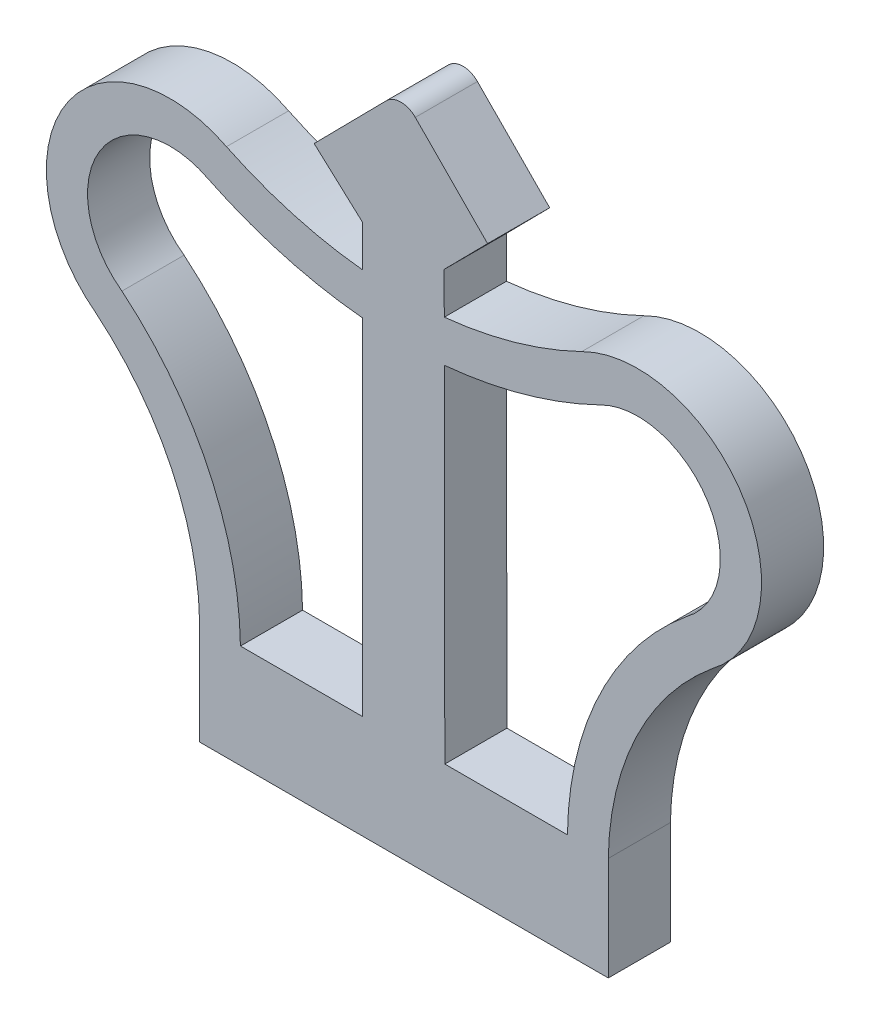
ISO-10303-21;
HEADER;
FILE_DESCRIPTION(('STEP AP214'),'2;1');
FILE_NAME('part.step','',(''),(''),'','','');
FILE_SCHEMA(('AUTOMOTIVE_DESIGN { 1 0 10303 214 1 1 1 1 }'));
ENDSEC;
DATA;
#1=APPLICATION_CONTEXT('core data for automotive mechanical design processes');
#2=APPLICATION_PROTOCOL_DEFINITION('international standard','automotive_design',2000,#1);
#3=PRODUCT_CONTEXT('',#1,'mechanical');
#4=PRODUCT('Part','Part','',(#3));
#5=PRODUCT_RELATED_PRODUCT_CATEGORY('part','',(#4));
#6=PRODUCT_DEFINITION_FORMATION('','',#4);
#7=PRODUCT_DEFINITION_CONTEXT('part definition',#1,'design');
#8=PRODUCT_DEFINITION('design','',#6,#7);
#9=PRODUCT_DEFINITION_SHAPE('','',#8);
#10=(LENGTH_UNIT() NAMED_UNIT(*) SI_UNIT(.MILLI.,.METRE.));
#11=(NAMED_UNIT(*) PLANE_ANGLE_UNIT() SI_UNIT($,.RADIAN.));
#12=(NAMED_UNIT(*) SI_UNIT($,.STERADIAN.) SOLID_ANGLE_UNIT());
#13=UNCERTAINTY_MEASURE_WITH_UNIT(LENGTH_MEASURE(1.E-05),#10,'distance_accuracy_value','');
#14=(GEOMETRIC_REPRESENTATION_CONTEXT(3) GLOBAL_UNCERTAINTY_ASSIGNED_CONTEXT((#13)) GLOBAL_UNIT_ASSIGNED_CONTEXT((#10,
#11,#12)) REPRESENTATION_CONTEXT('',''));
#15=CARTESIAN_POINT('',(0.,0.,0.));
#16=DIRECTION('',(0.,0.,1.));
#17=DIRECTION('',(1.,0.,0.));
#18=AXIS2_PLACEMENT_3D('',#15,#16,#17);
#19=CARTESIAN_POINT('',(61.8441932307296,31.3219073129325,3.));
#20=DIRECTION('',(0.,0.,1.));
#21=DIRECTION('',(1.,0.,0.));
#22=AXIS2_PLACEMENT_3D('',#19,#20,#21);
#23=PLANE('',#22);
#24=CARTESIAN_POINT('',(61.8441932307296,31.3219073129325,3.));
#25=DIRECTION('',(0.,0.,1.));
#26=DIRECTION('',(1.,0.,0.));
#27=AXIS2_PLACEMENT_3D('',#24,#25,#26);
#28=CIRCLE('',#27,0.986666666666719);
#29=CARTESIAN_POINT('',(62.5418719215003,32.0195860037033,3.));
#30=VERTEX_POINT('',#29);
#31=CARTESIAN_POINT('',(61.1465145399588,32.0195860037033,3.));
#32=VERTEX_POINT('',#31);
#33=EDGE_CURVE('E287',#30,#32,#28,.T.);
#34=ORIENTED_EDGE('',*,*,#33,.T.);
#35=DIRECTION('',(-0.702345280394572,-0.71183643283234,0.));
#36=VECTOR('',#35,1.);
#37=CARTESIAN_POINT('',(61.1465145399588,32.0195860037033,3.));
#38=LINE('',#37,#36);
#39=CARTESIAN_POINT('',(57.6581210861052,28.4840520977706,3.));
#40=VERTEX_POINT('',#39);
#41=EDGE_CURVE('E290',#32,#40,#38,.T.);
#42=ORIENTED_EDGE('',*,*,#41,.T.);
#43=DIRECTION('',(0.739794983569367,-0.672832358233163,0.));
#44=VECTOR('',#43,1.);
#45=CARTESIAN_POINT('',(57.6581210861052,28.4840520977706,3.));
#46=LINE('',#45,#44);
#47=CARTESIAN_POINT('',(59.990562636375,26.362731754211,3.));
#48=VERTEX_POINT('',#47);
#49=EDGE_CURVE('E293',#40,#48,#46,.T.);
#50=ORIENTED_EDGE('',*,*,#49,.T.);
#51=DIRECTION('',(0.,-1.,0.));
#52=VECTOR('',#51,1.);
#53=CARTESIAN_POINT('',(59.990562636375,26.362731754211,3.));
#54=LINE('',#53,#52);
#55=CARTESIAN_POINT('',(59.990562636375,24.368482397593,3.));
#56=VERTEX_POINT('',#55);
#57=EDGE_CURVE('E295',#48,#56,#54,.T.);
#58=ORIENTED_EDGE('',*,*,#57,.T.);
#59=CARTESIAN_POINT('',(62.0637401160861,44.1512448896681,3.));
#60=DIRECTION('',(0.,0.,-1.));
#61=DIRECTION('',(1.,0.,0.));
#62=AXIS2_PLACEMENT_3D('',#59,#60,#61);
#63=CIRCLE('',#62,19.8910974227225);
#64=CARTESIAN_POINT('',(53.4243604754694,26.2343010625102,3.));
#65=VERTEX_POINT('',#64);
#66=EDGE_CURVE('E297',#56,#65,#63,.T.);
#67=ORIENTED_EDGE('',*,*,#66,.T.);
#68=CARTESIAN_POINT('',(50.7041915014937,20.9118536638275,3.));
#69=DIRECTION('',(0.,0.,1.));
#70=DIRECTION('',(1.,0.,0.));
#71=AXIS2_PLACEMENT_3D('',#68,#69,#70);
#72=CIRCLE('',#71,5.97727074497421);
#73=CARTESIAN_POINT('',(47.1211327811651,16.1275610551546,3.));
#74=VERTEX_POINT('',#73);
#75=EDGE_CURVE('E299',#65,#74,#72,.T.);
#76=ORIENTED_EDGE('',*,*,#75,.T.);
#77=CARTESIAN_POINT('',(38.3153222567703,5.48593875935055,3.));
#78=DIRECTION('',(0.,0.,-1.));
#79=DIRECTION('',(1.,0.,0.));
#80=AXIS2_PLACEMENT_3D('',#77,#78,#79);
#81=CIRCLE('',#80,13.8125458941535);
#82=CARTESIAN_POINT('',(52.1263395641103,5.69142602040089,3.));
#83=VERTEX_POINT('',#82);
#84=EDGE_CURVE('E301',#74,#83,#81,.T.);
#85=ORIENTED_EDGE('',*,*,#84,.T.);
#86=DIRECTION('',(0.,-1.,0.));
#87=VECTOR('',#86,1.);
#88=CARTESIAN_POINT('',(52.1263395641103,0.691426020400794,3.));
#89=LINE('',#88,#87);
#90=CARTESIAN_POINT('',(52.1263395641103,0.691426020400794,3.));
#91=VERTEX_POINT('',#90);
#92=EDGE_CURVE('E303',#83,#91,#89,.T.);
#93=ORIENTED_EDGE('',*,*,#92,.T.);
#94=DIRECTION('',(1.,0.,0.));
#95=VECTOR('',#94,1.);
#96=CARTESIAN_POINT('',(52.1263395641103,0.691426020400794,3.));
#97=LINE('',#96,#95);
#98=CARTESIAN_POINT('',(71.8596728974437,0.691426020400794,3.));
#99=VERTEX_POINT('',#98);
#100=EDGE_CURVE('E305',#91,#99,#97,.T.);
#101=ORIENTED_EDGE('',*,*,#100,.T.);
#102=DIRECTION('',(0.,1.,0.));
#103=VECTOR('',#102,1.);
#104=CARTESIAN_POINT('',(71.8596728974437,0.691426020400794,3.));
#105=LINE('',#104,#103);
#106=CARTESIAN_POINT('',(71.8596728974437,5.69142602040079,3.));
#107=VERTEX_POINT('',#106);
#108=EDGE_CURVE('E307',#99,#107,#105,.T.);
#109=ORIENTED_EDGE('',*,*,#108,.T.);
#110=CARTESIAN_POINT('',(85.670688365914,5.48593922088933,3.));
#111=DIRECTION('',(0.,0.,-1.));
#112=DIRECTION('',(1.,0.,0.));
#113=AXIS2_PLACEMENT_3D('',#110,#111,#112);
#114=CIRCLE('',#113,13.8125440486211);
#115=CARTESIAN_POINT('',(76.86488668735,16.1275664410516,3.));
#116=VERTEX_POINT('',#115);
#117=EDGE_CURVE('E309',#107,#116,#114,.T.);
#118=ORIENTED_EDGE('',*,*,#117,.T.);
#119=CARTESIAN_POINT('',(73.2817051175117,20.9119135260737,3.));
#120=DIRECTION('',(0.,0.,1.));
#121=DIRECTION('',(1.,0.,0.));
#122=AXIS2_PLACEMENT_3D('',#119,#120,#121);
#123=CIRCLE('',#122,5.9773879907856);
#124=CARTESIAN_POINT('',(70.5787896763011,26.2432750135413,3.));
#125=VERTEX_POINT('',#124);
#126=EDGE_CURVE('E311',#116,#125,#123,.T.);
#127=ORIENTED_EDGE('',*,*,#126,.T.);
#128=CARTESIAN_POINT('',(61.9211461163445,44.1512682510637,3.));
#129=DIRECTION('',(0.,0.,-1.));
#130=DIRECTION('',(1.,0.,0.));
#131=AXIS2_PLACEMENT_3D('',#128,#129,#130);
#132=CIRCLE('',#131,19.8909782013456);
#133=CARTESIAN_POINT('',(63.940045397282,24.3630126558922,3.));
#134=VERTEX_POINT('',#133);
#135=EDGE_CURVE('E313',#125,#134,#132,.T.);
#136=ORIENTED_EDGE('',*,*,#135,.T.);
#137=DIRECTION('',(-0.00140824351293583,0.999999008424613,0.));
#138=VECTOR('',#137,1.);
#139=CARTESIAN_POINT('',(63.940045397282,24.3630126558922,3.));
#140=LINE('',#139,#138);
#141=CARTESIAN_POINT('',(63.9372293030417,26.362731754211,3.));
#142=VERTEX_POINT('',#141);
#143=EDGE_CURVE('E315',#134,#142,#140,.T.);
#144=ORIENTED_EDGE('',*,*,#143,.T.);
#145=DIRECTION('',(0.70234528039458,0.711836432832332,0.));
#146=VECTOR('',#145,1.);
#147=CARTESIAN_POINT('',(63.9372293030417,26.362731754211,3.));
#148=LINE('',#147,#146);
#149=CARTESIAN_POINT('',(66.0302653753539,28.4840520977706,3.));
#150=VERTEX_POINT('',#149);
#151=EDGE_CURVE('E317',#142,#150,#148,.T.);
#152=ORIENTED_EDGE('',*,*,#151,.T.);
#153=DIRECTION('',(-0.702345280394571,0.711836432832341,0.));
#154=VECTOR('',#153,1.);
#155=CARTESIAN_POINT('',(66.0302653753539,28.4840520977706,3.));
#156=LINE('',#155,#154);
#157=EDGE_CURVE('E319',#150,#30,#156,.T.);
#158=ORIENTED_EDGE('',*,*,#157,.T.);
#159=EDGE_LOOP('',(#34,#42,#50,#58,#67,#76,#85,#93,#101,#109,#118,#127,#136,#144,#152,#158));
#160=FACE_BOUND('',#159,.T.);
#161=DIRECTION('',(1.,0.,0.));
#162=VECTOR('',#161,1.);
#163=CARTESIAN_POINT('',(59.990562636375,5.69142602040079,3.));
#164=LINE('',#163,#162);
#165=CARTESIAN_POINT('',(54.0981590460785,5.69142602040079,3.));
#166=VERTEX_POINT('',#165);
#167=CARTESIAN_POINT('',(59.990562636375,5.69142602040079,3.));
#168=VERTEX_POINT('',#167);
#169=EDGE_CURVE('E251',#166,#168,#164,.T.);
#170=ORIENTED_EDGE('',*,*,#169,.F.);
#171=CARTESIAN_POINT('',(38.2888887822014,5.49959477211779,3.));
#172=DIRECTION('',(0.,0.,-1.));
#173=DIRECTION('',(1.,0.,0.));
#174=AXIS2_PLACEMENT_3D('',#171,#172,#173);
#175=CIRCLE('',#174,15.8104340707056);
#176=CARTESIAN_POINT('',(48.376647715735,17.6736222570153,3.));
#177=VERTEX_POINT('',#176);
#178=EDGE_CURVE('E249',#177,#166,#175,.T.);
#179=ORIENTED_EDGE('',*,*,#178,.F.);
#180=CARTESIAN_POINT('',(50.7016784881244,20.9102364235662,3.));
#181=DIRECTION('',(0.,0.,1.));
#182=DIRECTION('',(1.,0.,0.));
#183=AXIS2_PLACEMENT_3D('',#180,#181,#182);
#184=CIRCLE('',#183,3.98515236291857);
#185=CARTESIAN_POINT('',(52.5407715195739,24.4456538214627,3.));
#186=VERTEX_POINT('',#185);
#187=EDGE_CURVE('E259',#186,#177,#184,.T.);
#188=ORIENTED_EDGE('',*,*,#187,.F.);
#189=CARTESIAN_POINT('',(62.0697103117339,44.1259252707263,3.));
#190=DIRECTION('',(0.,0.,-1.));
#191=DIRECTION('',(1.,0.,0.));
#192=AXIS2_PLACEMENT_3D('',#189,#190,#191);
#193=CIRCLE('',#192,21.8658125579964);
#194=CARTESIAN_POINT('',(59.990562636375,22.3591867974161,3.));
#195=VERTEX_POINT('',#194);
#196=EDGE_CURVE('E256',#195,#186,#193,.T.);
#197=ORIENTED_EDGE('',*,*,#196,.F.);
#198=DIRECTION('',(0.,1.,0.));
#199=VECTOR('',#198,1.);
#200=CARTESIAN_POINT('',(59.990562636375,22.3591867974161,3.));
#201=LINE('',#200,#199);
#202=EDGE_CURVE('E254',#168,#195,#201,.T.);
#203=ORIENTED_EDGE('',*,*,#202,.F.);
#204=EDGE_LOOP('',(#170,#179,#188,#197,#203));
#205=FACE_BOUND('',#204,.T.);
#206=DIRECTION('',(0.00140824351293031,-0.999999008424613,0.));
#207=VECTOR('',#206,1.);
#208=CARTESIAN_POINT('',(63.9663395641102,5.69142602040079,3.));
#209=LINE('',#208,#207);
#210=CARTESIAN_POINT('',(63.9428739140804,22.3544722523832,3.));
#211=VERTEX_POINT('',#210);
#212=CARTESIAN_POINT('',(63.9663395641102,5.69142602040079,3.));
#213=VERTEX_POINT('',#212);
#214=EDGE_CURVE('E213',#211,#213,#209,.T.);
#215=ORIENTED_EDGE('',*,*,#214,.F.);
#216=CARTESIAN_POINT('',(61.915173494904,44.1259458894357,3.));
#217=DIRECTION('',(0.,0.,-1.));
#218=DIRECTION('',(1.,0.,0.));
#219=AXIS2_PLACEMENT_3D('',#216,#217,#218);
#220=CIRCLE('',#219,21.8656953541112);
#221=CARTESIAN_POINT('',(71.4599091327448,24.4534611728949,3.));
#222=VERTEX_POINT('',#221);
#223=EDGE_CURVE('E205',#222,#211,#220,.T.);
#224=ORIENTED_EDGE('',*,*,#223,.F.);
#225=CARTESIAN_POINT('',(73.2839800696653,20.9104761574397,3.));
#226=DIRECTION('',(0.,0.,1.));
#227=DIRECTION('',(1.,0.,0.));
#228=AXIS2_PLACEMENT_3D('',#225,#226,#227);
#229=CIRCLE('',#228,3.98496895880736);
#230=CARTESIAN_POINT('',(75.6470743121825,17.7017749866168,3.));
#231=VERTEX_POINT('',#230);
#232=EDGE_CURVE('E232',#231,#222,#229,.T.);
#233=ORIENTED_EDGE('',*,*,#232,.F.);
#234=CARTESIAN_POINT('',(85.6889849964046,5.49898737614838,3.));
#235=DIRECTION('',(0.,0.,-1.));
#236=DIRECTION('',(1.,0.,0.));
#237=AXIS2_PLACEMENT_3D('',#234,#235,#236);
#238=CIRCLE('',#237,15.8034172145171);
#239=CARTESIAN_POINT('',(69.8867394906452,5.69142602040079,3.));
#240=VERTEX_POINT('',#239);
#241=EDGE_CURVE('E228',#240,#231,#238,.T.);
#242=ORIENTED_EDGE('',*,*,#241,.F.);
#243=DIRECTION('',(1.,0.,0.));
#244=VECTOR('',#243,1.);
#245=CARTESIAN_POINT('',(69.8867394906452,5.69142602040079,3.));
#246=LINE('',#245,#244);
#247=EDGE_CURVE('E226',#213,#240,#246,.T.);
#248=ORIENTED_EDGE('',*,*,#247,.F.);
#249=EDGE_LOOP('',(#215,#224,#233,#242,#248));
#250=FACE_BOUND('',#249,.T.);
#251=ADVANCED_FACE('F32',(#160,#205,#250),#23,.T.);
#252=CARTESIAN_POINT('',(61.8441932307296,31.3219073129325,0.));
#253=DIRECTION('',(0.,0.,1.));
#254=DIRECTION('',(1.,0.,0.));
#255=AXIS2_PLACEMENT_3D('',#252,#253,#254);
#256=PLANE('',#255);
#257=CARTESIAN_POINT('',(38.2888887822014,5.49959477211779,0.));
#258=DIRECTION('',(0.,0.,-1.));
#259=DIRECTION('',(1.,0.,0.));
#260=AXIS2_PLACEMENT_3D('',#257,#258,#259);
#261=CIRCLE('',#260,15.8104340707056);
#262=CARTESIAN_POINT('',(48.376647715735,17.6736222570153,0.));
#263=VERTEX_POINT('',#262);
#264=CARTESIAN_POINT('',(54.0981590460785,5.69142602040079,0.));
#265=VERTEX_POINT('',#264);
#266=EDGE_CURVE('E221',#263,#265,#261,.T.);
#267=ORIENTED_EDGE('',*,*,#266,.T.);
#268=DIRECTION('',(1.,0.,0.));
#269=VECTOR('',#268,1.);
#270=CARTESIAN_POINT('',(59.990562636375,5.69142602040079,0.));
#271=LINE('',#270,#269);
#272=CARTESIAN_POINT('',(59.990562636375,5.69142602040079,0.));
#273=VERTEX_POINT('',#272);
#274=EDGE_CURVE('E264',#265,#273,#271,.T.);
#275=ORIENTED_EDGE('',*,*,#274,.T.);
#276=DIRECTION('',(0.,1.,0.));
#277=VECTOR('',#276,1.);
#278=CARTESIAN_POINT('',(59.990562636375,22.3591867974161,0.));
#279=LINE('',#278,#277);
#280=CARTESIAN_POINT('',(59.990562636375,22.3591867974161,0.));
#281=VERTEX_POINT('',#280);
#282=EDGE_CURVE('E267',#273,#281,#279,.T.);
#283=ORIENTED_EDGE('',*,*,#282,.T.);
#284=CARTESIAN_POINT('',(62.0697103117339,44.1259252707263,0.));
#285=DIRECTION('',(0.,0.,-1.));
#286=DIRECTION('',(1.,0.,0.));
#287=AXIS2_PLACEMENT_3D('',#284,#285,#286);
#288=CIRCLE('',#287,21.8658125579964);
#289=CARTESIAN_POINT('',(52.5407715195739,24.4456538214627,0.));
#290=VERTEX_POINT('',#289);
#291=EDGE_CURVE('E270',#281,#290,#288,.T.);
#292=ORIENTED_EDGE('',*,*,#291,.T.);
#293=CARTESIAN_POINT('',(50.7016784881244,20.9102364235662,0.));
#294=DIRECTION('',(0.,0.,1.));
#295=DIRECTION('',(1.,0.,0.));
#296=AXIS2_PLACEMENT_3D('',#293,#294,#295);
#297=CIRCLE('',#296,3.98515236291857);
#298=EDGE_CURVE('E252',#290,#263,#297,.T.);
#299=ORIENTED_EDGE('',*,*,#298,.T.);
#300=EDGE_LOOP('',(#267,#275,#283,#292,#299));
#301=FACE_BOUND('',#300,.T.);
#302=CARTESIAN_POINT('',(61.8441932307296,31.3219073129325,0.));
#303=DIRECTION('',(0.,0.,1.));
#304=DIRECTION('',(1.,0.,0.));
#305=AXIS2_PLACEMENT_3D('',#302,#303,#304);
#306=CIRCLE('',#305,0.986666666666719);
#307=CARTESIAN_POINT('',(62.5418719215003,32.0195860037033,0.));
#308=VERTEX_POINT('',#307);
#309=CARTESIAN_POINT('',(61.1465145399588,32.0195860037033,0.));
#310=VERTEX_POINT('',#309);
#311=EDGE_CURVE('E286',#308,#310,#306,.T.);
#312=ORIENTED_EDGE('',*,*,#311,.F.);
#313=DIRECTION('',(-0.702345280394571,0.711836432832341,0.));
#314=VECTOR('',#313,1.);
#315=CARTESIAN_POINT('',(66.0302653753539,28.4840520977706,0.));
#316=LINE('',#315,#314);
#317=CARTESIAN_POINT('',(66.0302653753539,28.4840520977706,0.));
#318=VERTEX_POINT('',#317);
#319=EDGE_CURVE('E291',#318,#308,#316,.T.);
#320=ORIENTED_EDGE('',*,*,#319,.F.);
#321=DIRECTION('',(0.70234528039458,0.711836432832332,0.));
#322=VECTOR('',#321,1.);
#323=CARTESIAN_POINT('',(63.9372293030417,26.362731754211,0.));
#324=LINE('',#323,#322);
#325=CARTESIAN_POINT('',(63.9372293030417,26.362731754211,0.));
#326=VERTEX_POINT('',#325);
#327=EDGE_CURVE('E351',#326,#318,#324,.T.);
#328=ORIENTED_EDGE('',*,*,#327,.F.);
#329=DIRECTION('',(-0.00140824351293583,0.999999008424613,0.));
#330=VECTOR('',#329,1.);
#331=CARTESIAN_POINT('',(63.940045397282,24.3630126558922,0.));
#332=LINE('',#331,#330);
#333=CARTESIAN_POINT('',(63.940045397282,24.3630126558922,0.));
#334=VERTEX_POINT('',#333);
#335=EDGE_CURVE('E349',#334,#326,#332,.T.);
#336=ORIENTED_EDGE('',*,*,#335,.F.);
#337=CARTESIAN_POINT('',(61.9211461163445,44.1512682510637,0.));
#338=DIRECTION('',(0.,0.,-1.));
#339=DIRECTION('',(1.,0.,0.));
#340=AXIS2_PLACEMENT_3D('',#337,#338,#339);
#341=CIRCLE('',#340,19.8909782013456);
#342=CARTESIAN_POINT('',(70.5787896763011,26.2432750135413,0.));
#343=VERTEX_POINT('',#342);
#344=EDGE_CURVE('E347',#343,#334,#341,.T.);
#345=ORIENTED_EDGE('',*,*,#344,.F.);
#346=CARTESIAN_POINT('',(73.2817051175117,20.9119135260737,0.));
#347=DIRECTION('',(0.,0.,1.));
#348=DIRECTION('',(1.,0.,0.));
#349=AXIS2_PLACEMENT_3D('',#346,#347,#348);
#350=CIRCLE('',#349,5.9773879907856);
#351=CARTESIAN_POINT('',(76.86488668735,16.1275664410516,0.));
#352=VERTEX_POINT('',#351);
#353=EDGE_CURVE('E345',#352,#343,#350,.T.);
#354=ORIENTED_EDGE('',*,*,#353,.F.);
#355=CARTESIAN_POINT('',(85.670688365914,5.48593922088933,0.));
#356=DIRECTION('',(0.,0.,-1.));
#357=DIRECTION('',(1.,0.,0.));
#358=AXIS2_PLACEMENT_3D('',#355,#356,#357);
#359=CIRCLE('',#358,13.8125440486211);
#360=CARTESIAN_POINT('',(71.8596728974437,5.69142602040079,0.));
#361=VERTEX_POINT('',#360);
#362=EDGE_CURVE('E343',#361,#352,#359,.T.);
#363=ORIENTED_EDGE('',*,*,#362,.F.);
#364=DIRECTION('',(0.,1.,0.));
#365=VECTOR('',#364,1.);
#366=CARTESIAN_POINT('',(71.8596728974437,0.691426020400794,0.));
#367=LINE('',#366,#365);
#368=CARTESIAN_POINT('',(71.8596728974437,0.691426020400794,0.));
#369=VERTEX_POINT('',#368);
#370=EDGE_CURVE('E341',#369,#361,#367,.T.);
#371=ORIENTED_EDGE('',*,*,#370,.F.);
#372=DIRECTION('',(1.,0.,0.));
#373=VECTOR('',#372,1.);
#374=CARTESIAN_POINT('',(52.1263395641103,0.691426020400794,0.));
#375=LINE('',#374,#373);
#376=CARTESIAN_POINT('',(52.1263395641103,0.691426020400794,0.));
#377=VERTEX_POINT('',#376);
#378=EDGE_CURVE('E339',#377,#369,#375,.T.);
#379=ORIENTED_EDGE('',*,*,#378,.F.);
#380=DIRECTION('',(0.,-1.,0.));
#381=VECTOR('',#380,1.);
#382=CARTESIAN_POINT('',(52.1263395641103,0.691426020400794,0.));
#383=LINE('',#382,#381);
#384=CARTESIAN_POINT('',(52.1263395641103,5.69142602040089,0.));
#385=VERTEX_POINT('',#384);
#386=EDGE_CURVE('E337',#385,#377,#383,.T.);
#387=ORIENTED_EDGE('',*,*,#386,.F.);
#388=CARTESIAN_POINT('',(38.3153222567703,5.48593875935055,0.));
#389=DIRECTION('',(0.,0.,-1.));
#390=DIRECTION('',(1.,0.,0.));
#391=AXIS2_PLACEMENT_3D('',#388,#389,#390);
#392=CIRCLE('',#391,13.8125458941536);
#393=CARTESIAN_POINT('',(47.1211327811651,16.1275610551546,0.));
#394=VERTEX_POINT('',#393);
#395=EDGE_CURVE('E335',#394,#385,#392,.T.);
#396=ORIENTED_EDGE('',*,*,#395,.F.);
#397=CARTESIAN_POINT('',(50.7041915014937,20.9118536638275,0.));
#398=DIRECTION('',(0.,0.,1.));
#399=DIRECTION('',(1.,0.,0.));
#400=AXIS2_PLACEMENT_3D('',#397,#398,#399);
#401=CIRCLE('',#400,5.97727074497421);
#402=CARTESIAN_POINT('',(53.4243604754694,26.2343010625102,0.));
#403=VERTEX_POINT('',#402);
#404=EDGE_CURVE('E332',#403,#394,#401,.T.);
#405=ORIENTED_EDGE('',*,*,#404,.F.);
#406=CARTESIAN_POINT('',(62.0637401160861,44.1512448896681,0.));
#407=DIRECTION('',(0.,0.,-1.));
#408=DIRECTION('',(1.,0.,0.));
#409=AXIS2_PLACEMENT_3D('',#406,#407,#408);
#410=CIRCLE('',#409,19.8910974227225);
#411=CARTESIAN_POINT('',(59.990562636375,24.368482397593,0.));
#412=VERTEX_POINT('',#411);
#413=EDGE_CURVE('E330',#412,#403,#410,.T.);
#414=ORIENTED_EDGE('',*,*,#413,.F.);
#415=DIRECTION('',(0.,-1.,0.));
#416=VECTOR('',#415,1.);
#417=CARTESIAN_POINT('',(59.990562636375,26.362731754211,0.));
#418=LINE('',#417,#416);
#419=CARTESIAN_POINT('',(59.990562636375,26.362731754211,0.));
#420=VERTEX_POINT('',#419);
#421=EDGE_CURVE('E328',#420,#412,#418,.T.);
#422=ORIENTED_EDGE('',*,*,#421,.F.);
#423=DIRECTION('',(0.739794983569367,-0.672832358233163,0.));
#424=VECTOR('',#423,1.);
#425=CARTESIAN_POINT('',(57.6581210861052,28.4840520977706,0.));
#426=LINE('',#425,#424);
#427=CARTESIAN_POINT('',(57.6581210861052,28.4840520977706,0.));
#428=VERTEX_POINT('',#427);
#429=EDGE_CURVE('E326',#428,#420,#426,.T.);
#430=ORIENTED_EDGE('',*,*,#429,.F.);
#431=DIRECTION('',(-0.702345280394572,-0.71183643283234,0.));
#432=VECTOR('',#431,1.);
#433=CARTESIAN_POINT('',(61.1465145399588,32.0195860037033,0.));
#434=LINE('',#433,#432);
#435=EDGE_CURVE('E324',#310,#428,#434,.T.);
#436=ORIENTED_EDGE('',*,*,#435,.F.);
#437=EDGE_LOOP('',(#312,#320,#328,#336,#345,#354,#363,#371,#379,#387,#396,#405,#414,#422,#430,#436));
#438=FACE_BOUND('',#437,.T.);
#439=CARTESIAN_POINT('',(61.915173494904,44.1259458894357,0.));
#440=DIRECTION('',(0.,0.,-1.));
#441=DIRECTION('',(1.,0.,0.));
#442=AXIS2_PLACEMENT_3D('',#439,#440,#441);
#443=CIRCLE('',#442,21.8656953541112);
#444=CARTESIAN_POINT('',(71.4599091327448,24.4534611728949,0.));
#445=VERTEX_POINT('',#444);
#446=CARTESIAN_POINT('',(63.9428739140804,22.3544722523832,0.));
#447=VERTEX_POINT('',#446);
#448=EDGE_CURVE('E55',#445,#447,#443,.T.);
#449=ORIENTED_EDGE('',*,*,#448,.T.);
#450=DIRECTION('',(0.00140824351293031,-0.999999008424613,0.));
#451=VECTOR('',#450,1.);
#452=CARTESIAN_POINT('',(63.9663395641102,5.69142602040079,0.));
#453=LINE('',#452,#451);
#454=CARTESIAN_POINT('',(63.9663395641102,5.69142602040079,0.));
#455=VERTEX_POINT('',#454);
#456=EDGE_CURVE('E220',#447,#455,#453,.T.);
#457=ORIENTED_EDGE('',*,*,#456,.T.);
#458=DIRECTION('',(1.,0.,0.));
#459=VECTOR('',#458,1.);
#460=CARTESIAN_POINT('',(69.8867394906452,5.69142602040079,0.));
#461=LINE('',#460,#459);
#462=CARTESIAN_POINT('',(69.8867394906452,5.69142602040079,0.));
#463=VERTEX_POINT('',#462);
#464=EDGE_CURVE('E236',#455,#463,#461,.T.);
#465=ORIENTED_EDGE('',*,*,#464,.T.);
#466=CARTESIAN_POINT('',(85.6889849964046,5.49898737614838,0.));
#467=DIRECTION('',(0.,0.,-1.));
#468=DIRECTION('',(1.,0.,0.));
#469=AXIS2_PLACEMENT_3D('',#466,#467,#468);
#470=CIRCLE('',#469,15.8034172145171);
#471=CARTESIAN_POINT('',(75.6470743121825,17.7017749866168,0.));
#472=VERTEX_POINT('',#471);
#473=EDGE_CURVE('E239',#463,#472,#470,.T.);
#474=ORIENTED_EDGE('',*,*,#473,.T.);
#475=CARTESIAN_POINT('',(73.2839800696653,20.9104761574397,0.));
#476=DIRECTION('',(0.,0.,1.));
#477=DIRECTION('',(1.,0.,0.));
#478=AXIS2_PLACEMENT_3D('',#475,#476,#477);
#479=CIRCLE('',#478,3.98496895880736);
#480=EDGE_CURVE('E214',#472,#445,#479,.T.);
#481=ORIENTED_EDGE('',*,*,#480,.T.);
#482=EDGE_LOOP('',(#449,#457,#465,#474,#481));
#483=FACE_BOUND('',#482,.T.);
#484=ADVANCED_FACE('F405',(#301,#438,#483),#256,.F.);
#485=CARTESIAN_POINT('',(61.8441932307296,31.3219073129325,3.));
#486=DIRECTION('',(0.,0.,-1.));
#487=DIRECTION('',(-1.,0.,0.));
#488=AXIS2_PLACEMENT_3D('',#485,#486,#487);
#489=CYLINDRICAL_SURFACE('',#488,0.986666666666719);
#490=ORIENTED_EDGE('',*,*,#311,.T.);
#491=DIRECTION('',(0.,0.,-1.));
#492=VECTOR('',#491,1.);
#493=CARTESIAN_POINT('',(61.1465145399588,32.0195860037033,3.));
#494=LINE('',#493,#492);
#495=EDGE_CURVE('E11',#32,#310,#494,.T.);
#496=ORIENTED_EDGE('',*,*,#495,.F.);
#497=ORIENTED_EDGE('',*,*,#33,.F.);
#498=DIRECTION('',(0.,0.,-1.));
#499=VECTOR('',#498,1.);
#500=CARTESIAN_POINT('',(62.5418719215003,32.0195860037033,3.));
#501=LINE('',#500,#499);
#502=EDGE_CURVE('E321',#30,#308,#501,.T.);
#503=ORIENTED_EDGE('',*,*,#502,.T.);
#504=EDGE_LOOP('',(#490,#496,#497,#503));
#505=FACE_BOUND('',#504,.T.);
#506=ADVANCED_FACE('F34',(#505),#489,.T.);
#507=CARTESIAN_POINT('',(61.1465145399588,32.0195860037033,3.));
#508=DIRECTION('',(0.71183643283234,-0.702345280394572,0.));
#509=DIRECTION('',(0.702345280394572,0.71183643283234,0.));
#510=AXIS2_PLACEMENT_3D('',#507,#508,#509);
#511=PLANE('',#510);
#512=ORIENTED_EDGE('',*,*,#435,.T.);
#513=DIRECTION('',(0.,0.,-1.));
#514=VECTOR('',#513,1.);
#515=CARTESIAN_POINT('',(57.6581210861052,28.4840520977706,3.));
#516=LINE('',#515,#514);
#517=EDGE_CURVE('E40',#40,#428,#516,.T.);
#518=ORIENTED_EDGE('',*,*,#517,.F.);
#519=ORIENTED_EDGE('',*,*,#41,.F.);
#520=ORIENTED_EDGE('',*,*,#495,.T.);
#521=EDGE_LOOP('',(#512,#518,#519,#520));
#522=FACE_BOUND('',#521,.T.);
#523=ADVANCED_FACE('F423',(#522),#511,.F.);
#524=CARTESIAN_POINT('',(57.6581210861052,28.4840520977706,3.));
#525=DIRECTION('',(0.672832358233163,0.739794983569367,0.));
#526=DIRECTION('',(-0.739794983569367,0.672832358233163,0.));
#527=AXIS2_PLACEMENT_3D('',#524,#525,#526);
#528=PLANE('',#527);
#529=ORIENTED_EDGE('',*,*,#429,.T.);
#530=DIRECTION('',(0.,0.,-1.));
#531=VECTOR('',#530,1.);
#532=CARTESIAN_POINT('',(59.990562636375,26.362731754211,3.));
#533=LINE('',#532,#531);
#534=EDGE_CURVE('E392',#48,#420,#533,.T.);
#535=ORIENTED_EDGE('',*,*,#534,.F.);
#536=ORIENTED_EDGE('',*,*,#49,.F.);
#537=ORIENTED_EDGE('',*,*,#517,.T.);
#538=EDGE_LOOP('',(#529,#535,#536,#537));
#539=FACE_BOUND('',#538,.T.);
#540=ADVANCED_FACE('F399',(#539),#528,.F.);
#541=CARTESIAN_POINT('',(59.990562636375,26.362731754211,3.));
#542=DIRECTION('',(1.,0.,0.));
#543=DIRECTION('',(0.,0.,-1.));
#544=AXIS2_PLACEMENT_3D('',#541,#542,#543);
#545=PLANE('',#544);
#546=ORIENTED_EDGE('',*,*,#421,.T.);
#547=DIRECTION('',(0.,0.,-1.));
#548=VECTOR('',#547,1.);
#549=CARTESIAN_POINT('',(59.990562636375,24.368482397593,3.));
#550=LINE('',#549,#548);
#551=EDGE_CURVE('E389',#56,#412,#550,.T.);
#552=ORIENTED_EDGE('',*,*,#551,.F.);
#553=ORIENTED_EDGE('',*,*,#57,.F.);
#554=ORIENTED_EDGE('',*,*,#534,.T.);
#555=EDGE_LOOP('',(#546,#552,#553,#554));
#556=FACE_BOUND('',#555,.T.);
#557=ADVANCED_FACE('F411',(#556),#545,.F.);
#558=CARTESIAN_POINT('',(62.0637401160861,44.1512448896681,3.));
#559=DIRECTION('',(0.,0.,-1.));
#560=DIRECTION('',(-1.,0.,0.));
#561=AXIS2_PLACEMENT_3D('',#558,#559,#560);
#562=CYLINDRICAL_SURFACE('',#561,19.8910974227225);
#563=ORIENTED_EDGE('',*,*,#413,.T.);
#564=DIRECTION('',(0.,0.,-1.));
#565=VECTOR('',#564,1.);
#566=CARTESIAN_POINT('',(53.4243604754694,26.2343010625102,3.));
#567=LINE('',#566,#565);
#568=EDGE_CURVE('E386',#65,#403,#567,.T.);
#569=ORIENTED_EDGE('',*,*,#568,.F.);
#570=ORIENTED_EDGE('',*,*,#66,.F.);
#571=ORIENTED_EDGE('',*,*,#551,.T.);
#572=EDGE_LOOP('',(#563,#569,#570,#571));
#573=FACE_BOUND('',#572,.T.);
#574=ADVANCED_FACE('F415',(#573),#562,.F.);
#575=CARTESIAN_POINT('',(50.7041915014937,20.9118536638275,3.));
#576=DIRECTION('',(0.,0.,-1.));
#577=DIRECTION('',(-1.,0.,0.));
#578=AXIS2_PLACEMENT_3D('',#575,#576,#577);
#579=CYLINDRICAL_SURFACE('',#578,5.97727074497421);
#580=ORIENTED_EDGE('',*,*,#404,.T.);
#581=DIRECTION('',(0.,0.,-1.));
#582=VECTOR('',#581,1.);
#583=CARTESIAN_POINT('',(47.1211327811651,16.1275610551546,3.));
#584=LINE('',#583,#582);
#585=EDGE_CURVE('E383',#74,#394,#584,.T.);
#586=ORIENTED_EDGE('',*,*,#585,.F.);
#587=ORIENTED_EDGE('',*,*,#75,.F.);
#588=ORIENTED_EDGE('',*,*,#568,.T.);
#589=EDGE_LOOP('',(#580,#586,#587,#588));
#590=FACE_BOUND('',#589,.T.);
#591=ADVANCED_FACE('F473',(#590),#579,.T.);
#592=CARTESIAN_POINT('',(38.3153222567703,5.48593875935055,3.));
#593=DIRECTION('',(0.,0.,-1.));
#594=DIRECTION('',(-1.,0.,0.));
#595=AXIS2_PLACEMENT_3D('',#592,#593,#594);
#596=CYLINDRICAL_SURFACE('',#595,13.8125458941536);
#597=ORIENTED_EDGE('',*,*,#395,.T.);
#598=DIRECTION('',(0.,0.,-1.));
#599=VECTOR('',#598,1.);
#600=CARTESIAN_POINT('',(52.1263395641103,5.69142602040089,3.));
#601=LINE('',#600,#599);
#602=EDGE_CURVE('E380',#83,#385,#601,.T.);
#603=ORIENTED_EDGE('',*,*,#602,.F.);
#604=ORIENTED_EDGE('',*,*,#84,.F.);
#605=ORIENTED_EDGE('',*,*,#585,.T.);
#606=EDGE_LOOP('',(#597,#603,#604,#605));
#607=FACE_BOUND('',#606,.T.);
#608=ADVANCED_FACE('F475',(#607),#596,.F.);
#609=CARTESIAN_POINT('',(52.1263395641103,0.691426020400794,3.));
#610=DIRECTION('',(1.,0.,0.));
#611=DIRECTION('',(0.,0.,-1.));
#612=AXIS2_PLACEMENT_3D('',#609,#610,#611);
#613=PLANE('',#612);
#614=ORIENTED_EDGE('',*,*,#386,.T.);
#615=DIRECTION('',(0.,0.,-1.));
#616=VECTOR('',#615,1.);
#617=CARTESIAN_POINT('',(52.1263395641103,0.691426020400794,3.));
#618=LINE('',#617,#616);
#619=EDGE_CURVE('E377',#91,#377,#618,.T.);
#620=ORIENTED_EDGE('',*,*,#619,.F.);
#621=ORIENTED_EDGE('',*,*,#92,.F.);
#622=ORIENTED_EDGE('',*,*,#602,.T.);
#623=EDGE_LOOP('',(#614,#620,#621,#622));
#624=FACE_BOUND('',#623,.T.);
#625=ADVANCED_FACE('F469',(#624),#613,.F.);
#626=CARTESIAN_POINT('',(52.1263395641103,0.691426020400794,3.));
#627=DIRECTION('',(0.,1.,0.));
#628=DIRECTION('',(0.,0.,1.));
#629=AXIS2_PLACEMENT_3D('',#626,#627,#628);
#630=PLANE('',#629);
#631=ORIENTED_EDGE('',*,*,#378,.T.);
#632=DIRECTION('',(0.,0.,-1.));
#633=VECTOR('',#632,1.);
#634=CARTESIAN_POINT('',(71.8596728974437,0.691426020400794,3.));
#635=LINE('',#634,#633);
#636=EDGE_CURVE('E374',#99,#369,#635,.T.);
#637=ORIENTED_EDGE('',*,*,#636,.F.);
#638=ORIENTED_EDGE('',*,*,#100,.F.);
#639=ORIENTED_EDGE('',*,*,#619,.T.);
#640=EDGE_LOOP('',(#631,#637,#638,#639));
#641=FACE_BOUND('',#640,.T.);
#642=ADVANCED_FACE('F465',(#641),#630,.F.);
#643=CARTESIAN_POINT('',(71.8596728974437,0.691426020400794,3.));
#644=DIRECTION('',(-1.,0.,0.));
#645=DIRECTION('',(0.,0.,1.));
#646=AXIS2_PLACEMENT_3D('',#643,#644,#645);
#647=PLANE('',#646);
#648=ORIENTED_EDGE('',*,*,#370,.T.);
#649=DIRECTION('',(0.,0.,-1.));
#650=VECTOR('',#649,1.);
#651=CARTESIAN_POINT('',(71.8596728974437,5.69142602040079,3.));
#652=LINE('',#651,#650);
#653=EDGE_CURVE('E371',#107,#361,#652,.T.);
#654=ORIENTED_EDGE('',*,*,#653,.F.);
#655=ORIENTED_EDGE('',*,*,#108,.F.);
#656=ORIENTED_EDGE('',*,*,#636,.T.);
#657=EDGE_LOOP('',(#648,#654,#655,#656));
#658=FACE_BOUND('',#657,.T.);
#659=ADVANCED_FACE('F460',(#658),#647,.F.);
#660=CARTESIAN_POINT('',(85.670688365914,5.48593922088933,3.));
#661=DIRECTION('',(0.,0.,-1.));
#662=DIRECTION('',(-1.,0.,0.));
#663=AXIS2_PLACEMENT_3D('',#660,#661,#662);
#664=CYLINDRICAL_SURFACE('',#663,13.8125440486211);
#665=ORIENTED_EDGE('',*,*,#362,.T.);
#666=DIRECTION('',(0.,0.,-1.));
#667=VECTOR('',#666,1.);
#668=CARTESIAN_POINT('',(76.86488668735,16.1275664410516,3.));
#669=LINE('',#668,#667);
#670=EDGE_CURVE('E368',#116,#352,#669,.T.);
#671=ORIENTED_EDGE('',*,*,#670,.F.);
#672=ORIENTED_EDGE('',*,*,#117,.F.);
#673=ORIENTED_EDGE('',*,*,#653,.T.);
#674=EDGE_LOOP('',(#665,#671,#672,#673));
#675=FACE_BOUND('',#674,.T.);
#676=ADVANCED_FACE('F454',(#675),#664,.F.);
#677=CARTESIAN_POINT('',(73.2817051175117,20.9119135260737,3.));
#678=DIRECTION('',(0.,0.,-1.));
#679=DIRECTION('',(-1.,0.,0.));
#680=AXIS2_PLACEMENT_3D('',#677,#678,#679);
#681=CYLINDRICAL_SURFACE('',#680,5.9773879907856);
#682=ORIENTED_EDGE('',*,*,#353,.T.);
#683=DIRECTION('',(0.,0.,-1.));
#684=VECTOR('',#683,1.);
#685=CARTESIAN_POINT('',(70.5787896763011,26.2432750135413,3.));
#686=LINE('',#685,#684);
#687=EDGE_CURVE('E365',#125,#343,#686,.T.);
#688=ORIENTED_EDGE('',*,*,#687,.F.);
#689=ORIENTED_EDGE('',*,*,#126,.F.);
#690=ORIENTED_EDGE('',*,*,#670,.T.);
#691=EDGE_LOOP('',(#682,#688,#689,#690));
#692=FACE_BOUND('',#691,.T.);
#693=ADVANCED_FACE('F450',(#692),#681,.T.);
#694=CARTESIAN_POINT('',(61.9211461163445,44.1512682510637,3.));
#695=DIRECTION('',(0.,0.,-1.));
#696=DIRECTION('',(-1.,0.,0.));
#697=AXIS2_PLACEMENT_3D('',#694,#695,#696);
#698=CYLINDRICAL_SURFACE('',#697,19.8909782013456);
#699=ORIENTED_EDGE('',*,*,#344,.T.);
#700=DIRECTION('',(0.,0.,-1.));
#701=VECTOR('',#700,1.);
#702=CARTESIAN_POINT('',(63.940045397282,24.3630126558922,3.));
#703=LINE('',#702,#701);
#704=EDGE_CURVE('E362',#134,#334,#703,.T.);
#705=ORIENTED_EDGE('',*,*,#704,.F.);
#706=ORIENTED_EDGE('',*,*,#135,.F.);
#707=ORIENTED_EDGE('',*,*,#687,.T.);
#708=EDGE_LOOP('',(#699,#705,#706,#707));
#709=FACE_BOUND('',#708,.T.);
#710=ADVANCED_FACE('F445',(#709),#698,.F.);
#711=CARTESIAN_POINT('',(63.940045397282,24.3630126558922,3.));
#712=DIRECTION('',(-0.999999008424613,-0.00140824351293583,0.));
#713=DIRECTION('',(0.00140824351293583,-0.999999008424613,0.));
#714=AXIS2_PLACEMENT_3D('',#711,#712,#713);
#715=PLANE('',#714);
#716=ORIENTED_EDGE('',*,*,#335,.T.);
#717=DIRECTION('',(0.,0.,-1.));
#718=VECTOR('',#717,1.);
#719=CARTESIAN_POINT('',(63.9372293030417,26.362731754211,3.));
#720=LINE('',#719,#718);
#721=EDGE_CURVE('E359',#142,#326,#720,.T.);
#722=ORIENTED_EDGE('',*,*,#721,.F.);
#723=ORIENTED_EDGE('',*,*,#143,.F.);
#724=ORIENTED_EDGE('',*,*,#704,.T.);
#725=EDGE_LOOP('',(#716,#722,#723,#724));
#726=FACE_BOUND('',#725,.T.);
#727=ADVANCED_FACE('F439',(#726),#715,.F.);
#728=CARTESIAN_POINT('',(63.9372293030417,26.362731754211,3.));
#729=DIRECTION('',(-0.711836432832332,0.70234528039458,0.));
#730=DIRECTION('',(-0.70234528039458,-0.711836432832332,0.));
#731=AXIS2_PLACEMENT_3D('',#728,#729,#730);
#732=PLANE('',#731);
#733=ORIENTED_EDGE('',*,*,#327,.T.);
#734=DIRECTION('',(0.,0.,-1.));
#735=VECTOR('',#734,1.);
#736=CARTESIAN_POINT('',(66.0302653753539,28.4840520977706,3.));
#737=LINE('',#736,#735);
#738=EDGE_CURVE('E356',#150,#318,#737,.T.);
#739=ORIENTED_EDGE('',*,*,#738,.F.);
#740=ORIENTED_EDGE('',*,*,#151,.F.);
#741=ORIENTED_EDGE('',*,*,#721,.T.);
#742=EDGE_LOOP('',(#733,#739,#740,#741));
#743=FACE_BOUND('',#742,.T.);
#744=ADVANCED_FACE('F435',(#743),#732,.F.);
#745=CARTESIAN_POINT('',(66.0302653753539,28.4840520977706,3.));
#746=DIRECTION('',(-0.711836432832341,-0.702345280394571,0.));
#747=DIRECTION('',(0.702345280394571,-0.711836432832341,0.));
#748=AXIS2_PLACEMENT_3D('',#745,#746,#747);
#749=PLANE('',#748);
#750=ORIENTED_EDGE('',*,*,#319,.T.);
#751=ORIENTED_EDGE('',*,*,#502,.F.);
#752=ORIENTED_EDGE('',*,*,#157,.F.);
#753=ORIENTED_EDGE('',*,*,#738,.T.);
#754=EDGE_LOOP('',(#750,#751,#752,#753));
#755=FACE_BOUND('',#754,.T.);
#756=ADVANCED_FACE('F430',(#755),#749,.F.);
#757=CARTESIAN_POINT('',(38.2888887822014,5.49959477211779,3.));
#758=DIRECTION('',(0.,0.,-1.));
#759=DIRECTION('',(-1.,0.,0.));
#760=AXIS2_PLACEMENT_3D('',#757,#758,#759);
#761=CYLINDRICAL_SURFACE('',#760,15.8104340707056);
#762=ORIENTED_EDGE('',*,*,#266,.F.);
#763=DIRECTION('',(0.,0.,-1.));
#764=VECTOR('',#763,1.);
#765=CARTESIAN_POINT('',(48.376647715735,17.6736222570153,3.));
#766=LINE('',#765,#764);
#767=EDGE_CURVE('E261',#177,#263,#766,.T.);
#768=ORIENTED_EDGE('',*,*,#767,.F.);
#769=ORIENTED_EDGE('',*,*,#178,.T.);
#770=DIRECTION('',(0.,0.,-1.));
#771=VECTOR('',#770,1.);
#772=CARTESIAN_POINT('',(54.0981590460785,5.69142602040079,3.));
#773=LINE('',#772,#771);
#774=EDGE_CURVE('E283',#166,#265,#773,.T.);
#775=ORIENTED_EDGE('',*,*,#774,.T.);
#776=EDGE_LOOP('',(#762,#768,#769,#775));
#777=FACE_BOUND('',#776,.T.);
#778=ADVANCED_FACE('F492',(#777),#761,.T.);
#779=CARTESIAN_POINT('',(59.990562636375,5.69142602040079,3.));
#780=DIRECTION('',(0.,1.,0.));
#781=DIRECTION('',(0.,0.,1.));
#782=AXIS2_PLACEMENT_3D('',#779,#780,#781);
#783=PLANE('',#782);
#784=ORIENTED_EDGE('',*,*,#274,.F.);
#785=ORIENTED_EDGE('',*,*,#774,.F.);
#786=ORIENTED_EDGE('',*,*,#169,.T.);
#787=DIRECTION('',(0.,0.,-1.));
#788=VECTOR('',#787,1.);
#789=CARTESIAN_POINT('',(59.990562636375,5.69142602040079,3.));
#790=LINE('',#789,#788);
#791=EDGE_CURVE('E281',#168,#273,#790,.T.);
#792=ORIENTED_EDGE('',*,*,#791,.T.);
#793=EDGE_LOOP('',(#784,#785,#786,#792));
#794=FACE_BOUND('',#793,.T.);
#795=ADVANCED_FACE('F548',(#794),#783,.T.);
#796=CARTESIAN_POINT('',(59.990562636375,22.3591867974161,3.));
#797=DIRECTION('',(-1.,0.,0.));
#798=DIRECTION('',(0.,0.,1.));
#799=AXIS2_PLACEMENT_3D('',#796,#797,#798);
#800=PLANE('',#799);
#801=ORIENTED_EDGE('',*,*,#282,.F.);
#802=ORIENTED_EDGE('',*,*,#791,.F.);
#803=ORIENTED_EDGE('',*,*,#202,.T.);
#804=DIRECTION('',(0.,0.,-1.));
#805=VECTOR('',#804,1.);
#806=CARTESIAN_POINT('',(59.990562636375,22.3591867974161,3.));
#807=LINE('',#806,#805);
#808=EDGE_CURVE('E279',#195,#281,#807,.T.);
#809=ORIENTED_EDGE('',*,*,#808,.T.);
#810=EDGE_LOOP('',(#801,#802,#803,#809));
#811=FACE_BOUND('',#810,.T.);
#812=ADVANCED_FACE('F555',(#811),#800,.T.);
#813=CARTESIAN_POINT('',(62.0697103117339,44.1259252707263,3.));
#814=DIRECTION('',(0.,0.,-1.));
#815=DIRECTION('',(-1.,0.,0.));
#816=AXIS2_PLACEMENT_3D('',#813,#814,#815);
#817=CYLINDRICAL_SURFACE('',#816,21.8658125579964);
#818=ORIENTED_EDGE('',*,*,#291,.F.);
#819=ORIENTED_EDGE('',*,*,#808,.F.);
#820=ORIENTED_EDGE('',*,*,#196,.T.);
#821=DIRECTION('',(0.,0.,-1.));
#822=VECTOR('',#821,1.);
#823=CARTESIAN_POINT('',(52.5407715195739,24.4456538214627,3.));
#824=LINE('',#823,#822);
#825=EDGE_CURVE('E277',#186,#290,#824,.T.);
#826=ORIENTED_EDGE('',*,*,#825,.T.);
#827=EDGE_LOOP('',(#818,#819,#820,#826));
#828=FACE_BOUND('',#827,.T.);
#829=ADVANCED_FACE('F562',(#828),#817,.T.);
#830=CARTESIAN_POINT('',(50.7016784881244,20.9102364235662,3.));
#831=DIRECTION('',(0.,0.,-1.));
#832=DIRECTION('',(-1.,0.,0.));
#833=AXIS2_PLACEMENT_3D('',#830,#831,#832);
#834=CYLINDRICAL_SURFACE('',#833,3.98515236291857);
#835=ORIENTED_EDGE('',*,*,#298,.F.);
#836=ORIENTED_EDGE('',*,*,#825,.F.);
#837=ORIENTED_EDGE('',*,*,#187,.T.);
#838=ORIENTED_EDGE('',*,*,#767,.T.);
#839=EDGE_LOOP('',(#835,#836,#837,#838));
#840=FACE_BOUND('',#839,.T.);
#841=ADVANCED_FACE('F570',(#840),#834,.F.);
#842=CARTESIAN_POINT('',(61.915173494904,44.1259458894357,3.));
#843=DIRECTION('',(0.,0.,-1.));
#844=DIRECTION('',(-1.,0.,0.));
#845=AXIS2_PLACEMENT_3D('',#842,#843,#844);
#846=CYLINDRICAL_SURFACE('',#845,21.8656953541112);
#847=ORIENTED_EDGE('',*,*,#448,.F.);
#848=DIRECTION('',(0.,0.,-1.));
#849=VECTOR('',#848,1.);
#850=CARTESIAN_POINT('',(71.4599091327448,24.4534611728949,3.));
#851=LINE('',#850,#849);
#852=EDGE_CURVE('E209',#222,#445,#851,.T.);
#853=ORIENTED_EDGE('',*,*,#852,.F.);
#854=ORIENTED_EDGE('',*,*,#223,.T.);
#855=DIRECTION('',(0.,0.,-1.));
#856=VECTOR('',#855,1.);
#857=CARTESIAN_POINT('',(63.9428739140804,22.3544722523832,3.));
#858=LINE('',#857,#856);
#859=EDGE_CURVE('E208',#211,#447,#858,.T.);
#860=ORIENTED_EDGE('',*,*,#859,.T.);
#861=EDGE_LOOP('',(#847,#853,#854,#860));
#862=FACE_BOUND('',#861,.T.);
#863=ADVANCED_FACE('F207',(#862),#846,.T.);
#864=CARTESIAN_POINT('',(63.9663395641102,5.69142602040079,3.));
#865=DIRECTION('',(0.999999008424612,0.00140824351293031,0.));
#866=DIRECTION('',(-0.00140824351293031,0.999999008424613,0.));
#867=AXIS2_PLACEMENT_3D('',#864,#865,#866);
#868=PLANE('',#867);
#869=ORIENTED_EDGE('',*,*,#456,.F.);
#870=ORIENTED_EDGE('',*,*,#859,.F.);
#871=ORIENTED_EDGE('',*,*,#214,.T.);
#872=DIRECTION('',(0.,0.,-1.));
#873=VECTOR('',#872,1.);
#874=CARTESIAN_POINT('',(63.9663395641102,5.69142602040079,3.));
#875=LINE('',#874,#873);
#876=EDGE_CURVE('E222',#213,#455,#875,.T.);
#877=ORIENTED_EDGE('',*,*,#876,.T.);
#878=EDGE_LOOP('',(#869,#870,#871,#877));
#879=FACE_BOUND('',#878,.T.);
#880=ADVANCED_FACE('F217',(#879),#868,.T.);
#881=CARTESIAN_POINT('',(69.8867394906452,5.69142602040079,3.));
#882=DIRECTION('',(0.,1.,0.));
#883=DIRECTION('',(0.,0.,1.));
#884=AXIS2_PLACEMENT_3D('',#881,#882,#883);
#885=PLANE('',#884);
#886=ORIENTED_EDGE('',*,*,#464,.F.);
#887=ORIENTED_EDGE('',*,*,#876,.F.);
#888=ORIENTED_EDGE('',*,*,#247,.T.);
#889=DIRECTION('',(0.,0.,-1.));
#890=VECTOR('',#889,1.);
#891=CARTESIAN_POINT('',(69.8867394906452,5.69142602040079,3.));
#892=LINE('',#891,#890);
#893=EDGE_CURVE('E246',#240,#463,#892,.T.);
#894=ORIENTED_EDGE('',*,*,#893,.T.);
#895=EDGE_LOOP('',(#886,#887,#888,#894));
#896=FACE_BOUND('',#895,.T.);
#897=ADVANCED_FACE('F591',(#896),#885,.T.);
#898=CARTESIAN_POINT('',(85.6889849964046,5.49898737614838,3.));
#899=DIRECTION('',(0.,0.,-1.));
#900=DIRECTION('',(-1.,0.,0.));
#901=AXIS2_PLACEMENT_3D('',#898,#899,#900);
#902=CYLINDRICAL_SURFACE('',#901,15.8034172145171);
#903=ORIENTED_EDGE('',*,*,#473,.F.);
#904=ORIENTED_EDGE('',*,*,#893,.F.);
#905=ORIENTED_EDGE('',*,*,#241,.T.);
#906=DIRECTION('',(0.,0.,-1.));
#907=VECTOR('',#906,1.);
#908=CARTESIAN_POINT('',(75.6470743121825,17.7017749866168,3.));
#909=LINE('',#908,#907);
#910=EDGE_CURVE('E47',#231,#472,#909,.T.);
#911=ORIENTED_EDGE('',*,*,#910,.T.);
#912=EDGE_LOOP('',(#903,#904,#905,#911));
#913=FACE_BOUND('',#912,.T.);
#914=ADVANCED_FACE('F598',(#913),#902,.T.);
#915=CARTESIAN_POINT('',(73.2839800696653,20.9104761574397,3.));
#916=DIRECTION('',(0.,0.,-1.));
#917=DIRECTION('',(-1.,0.,0.));
#918=AXIS2_PLACEMENT_3D('',#915,#916,#917);
#919=CYLINDRICAL_SURFACE('',#918,3.98496895880736);
#920=ORIENTED_EDGE('',*,*,#480,.F.);
#921=ORIENTED_EDGE('',*,*,#910,.F.);
#922=ORIENTED_EDGE('',*,*,#232,.T.);
#923=ORIENTED_EDGE('',*,*,#852,.T.);
#924=EDGE_LOOP('',(#920,#921,#922,#923));
#925=FACE_BOUND('',#924,.T.);
#926=ADVANCED_FACE('F606',(#925),#919,.F.);
#927=CLOSED_SHELL('',(#251,#484,#506,#523,#540,#557,#574,#591,#608,#625,#642,#659,#676,#693,
#710,#727,#744,#756,#778,#795,#812,#829,#841,#863,#880,#897,#914,#926));
#928=MANIFOLD_SOLID_BREP('B2',#927);
#929=ADVANCED_BREP_SHAPE_REPRESENTATION('',(#18,#928),#14);
#930=SHAPE_DEFINITION_REPRESENTATION(#9,#929);
ENDSEC;
END-ISO-10303-21;
